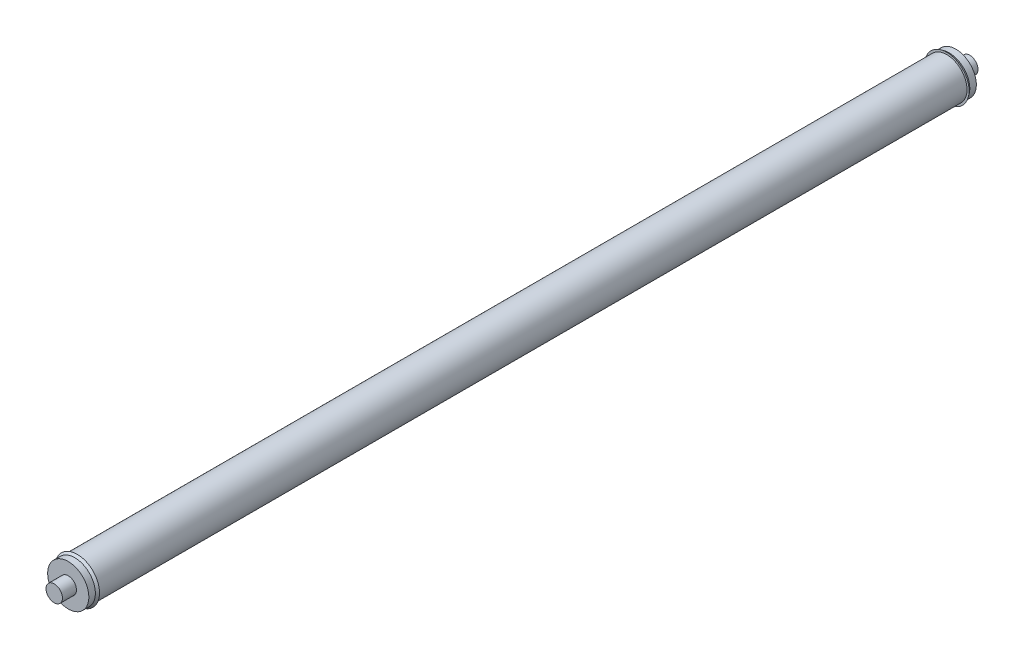
ISO-10303-21;
HEADER;
FILE_DESCRIPTION(('STEP AP214'),'2;1');
FILE_NAME('part.step','',(''),(''),'','','');
FILE_SCHEMA(('AUTOMOTIVE_DESIGN { 1 0 10303 214 1 1 1 1 }'));
ENDSEC;
DATA;
#1=APPLICATION_CONTEXT('core data for automotive mechanical design processes');
#2=APPLICATION_PROTOCOL_DEFINITION('international standard','automotive_design',2000,#1);
#3=PRODUCT_CONTEXT('',#1,'mechanical');
#4=PRODUCT('Part','Part','',(#3));
#5=PRODUCT_RELATED_PRODUCT_CATEGORY('part','',(#4));
#6=PRODUCT_DEFINITION_FORMATION('','',#4);
#7=PRODUCT_DEFINITION_CONTEXT('part definition',#1,'design');
#8=PRODUCT_DEFINITION('design','',#6,#7);
#9=PRODUCT_DEFINITION_SHAPE('','',#8);
#10=(LENGTH_UNIT() NAMED_UNIT(*) SI_UNIT(.MILLI.,.METRE.));
#11=(NAMED_UNIT(*) PLANE_ANGLE_UNIT() SI_UNIT($,.RADIAN.));
#12=(NAMED_UNIT(*) SI_UNIT($,.STERADIAN.) SOLID_ANGLE_UNIT());
#13=UNCERTAINTY_MEASURE_WITH_UNIT(LENGTH_MEASURE(1.E-05),#10,'distance_accuracy_value','');
#14=(GEOMETRIC_REPRESENTATION_CONTEXT(3) GLOBAL_UNCERTAINTY_ASSIGNED_CONTEXT((#13)) GLOBAL_UNIT_ASSIGNED_CONTEXT((#10,
#11,#12)) REPRESENTATION_CONTEXT('',''));
#15=CARTESIAN_POINT('',(0.,0.,0.));
#16=DIRECTION('',(0.,0.,1.));
#17=DIRECTION('',(1.,0.,0.));
#18=AXIS2_PLACEMENT_3D('',#15,#16,#17);
#19=CARTESIAN_POINT('',(1.01500000000002,0.,56.5));
#20=DIRECTION('',(0.,0.,-1.));
#21=DIRECTION('',(-1.,0.,0.));
#22=AXIS2_PLACEMENT_3D('',#19,#20,#21);
#23=PLANE('',#22);
#24=CARTESIAN_POINT('',(0.,0.,56.5));
#25=DIRECTION('',(0.,0.,-1.));
#26=DIRECTION('',(-1.,0.,0.));
#27=AXIS2_PLACEMENT_3D('',#24,#25,#26);
#28=CIRCLE('',#27,1.01500000000002);
#29=CARTESIAN_POINT('',(-1.01500000000002,0.,56.5));
#30=VERTEX_POINT('',#29);
#31=EDGE_CURVE('E71',#30,#30,#28,.T.);
#32=ORIENTED_EDGE('',*,*,#31,.F.);
#33=EDGE_LOOP('',(#32));
#34=FACE_BOUND('',#33,.T.);
#35=ADVANCED_FACE('F31',(#34),#23,.F.);
#36=CARTESIAN_POINT('',(1.01500000000002,0.,-56.5));
#37=DIRECTION('',(0.,0.,1.));
#38=DIRECTION('',(1.,0.,0.));
#39=AXIS2_PLACEMENT_3D('',#36,#37,#38);
#40=PLANE('',#39);
#41=CARTESIAN_POINT('',(0.,0.,-56.5));
#42=DIRECTION('',(0.,0.,-1.));
#43=DIRECTION('',(-1.,0.,0.));
#44=AXIS2_PLACEMENT_3D('',#41,#42,#43);
#45=CIRCLE('',#44,1.01500000000002);
#46=CARTESIAN_POINT('',(-1.01500000000002,0.,-56.5));
#47=VERTEX_POINT('',#46);
#48=EDGE_CURVE('E10',#47,#47,#45,.T.);
#49=ORIENTED_EDGE('',*,*,#48,.T.);
#50=EDGE_LOOP('',(#49));
#51=FACE_BOUND('',#50,.T.);
#52=ADVANCED_FACE('F78',(#51),#40,.F.);
#53=CARTESIAN_POINT('',(0.,0.,-71.4139111653637));
#54=DIRECTION('',(0.,0.,-1.));
#55=DIRECTION('',(-1.,0.,0.));
#56=AXIS2_PLACEMENT_3D('',#53,#54,#55);
#57=CYLINDRICAL_SURFACE('',#56,1.01500000000002);
#58=ORIENTED_EDGE('',*,*,#48,.F.);
#59=EDGE_LOOP('',(#58));
#60=FACE_BOUND('',#59,.T.);
#61=CARTESIAN_POINT('',(0.,0.,-54.77));
#62=DIRECTION('',(0.,0.,-1.));
#63=DIRECTION('',(-1.,0.,0.));
#64=AXIS2_PLACEMENT_3D('',#61,#62,#63);
#65=CIRCLE('',#64,1.01500000000002);
#66=CARTESIAN_POINT('',(-1.01500000000002,0.,-54.77));
#67=VERTEX_POINT('',#66);
#68=EDGE_CURVE('E37',#67,#67,#65,.T.);
#69=ORIENTED_EDGE('',*,*,#68,.T.);
#70=EDGE_LOOP('',(#69));
#71=FACE_BOUND('',#70,.T.);
#72=ADVANCED_FACE('F82',(#60,#71),#57,.T.);
#73=CARTESIAN_POINT('',(2.54000000000002,0.,-54.77));
#74=DIRECTION('',(0.,0.,1.));
#75=DIRECTION('',(1.,0.,0.));
#76=AXIS2_PLACEMENT_3D('',#73,#74,#75);
#77=PLANE('',#76);
#78=ORIENTED_EDGE('',*,*,#68,.F.);
#79=EDGE_LOOP('',(#78));
#80=FACE_BOUND('',#79,.T.);
#81=CARTESIAN_POINT('',(0.,0.,-54.77));
#82=DIRECTION('',(0.,0.,-1.));
#83=DIRECTION('',(-1.,0.,0.));
#84=AXIS2_PLACEMENT_3D('',#81,#82,#83);
#85=CIRCLE('',#84,2.54000000000002);
#86=CARTESIAN_POINT('',(-2.54000000000002,0.,-54.77));
#87=VERTEX_POINT('',#86);
#88=EDGE_CURVE('E41',#87,#87,#85,.T.);
#89=ORIENTED_EDGE('',*,*,#88,.T.);
#90=EDGE_LOOP('',(#89));
#91=FACE_BOUND('',#90,.T.);
#92=ADVANCED_FACE('F86',(#80,#91),#77,.F.);
#93=CARTESIAN_POINT('',(0.,0.,-71.4139111653637));
#94=DIRECTION('',(0.,0.,-1.));
#95=DIRECTION('',(-1.,0.,0.));
#96=AXIS2_PLACEMENT_3D('',#93,#94,#95);
#97=CYLINDRICAL_SURFACE('',#96,2.54000000000002);
#98=ORIENTED_EDGE('',*,*,#88,.F.);
#99=EDGE_LOOP('',(#98));
#100=FACE_BOUND('',#99,.T.);
#101=CARTESIAN_POINT('',(0.,0.,-53.96));
#102=DIRECTION('',(0.,0.,-1.));
#103=DIRECTION('',(-1.,0.,0.));
#104=AXIS2_PLACEMENT_3D('',#101,#102,#103);
#105=CIRCLE('',#104,2.54000000000002);
#106=CARTESIAN_POINT('',(-2.54000000000002,0.,-53.96));
#107=VERTEX_POINT('',#106);
#108=EDGE_CURVE('E45',#107,#107,#105,.T.);
#109=ORIENTED_EDGE('',*,*,#108,.T.);
#110=EDGE_LOOP('',(#109));
#111=FACE_BOUND('',#110,.T.);
#112=ADVANCED_FACE('F92',(#100,#111),#97,.T.);
#113=CARTESIAN_POINT('',(0.,0.,-53.66));
#114=DIRECTION('',(0.,0.,1.));
#115=DIRECTION('',(1.,0.,0.));
#116=AXIS2_PLACEMENT_3D('',#113,#114,#115);
#117=CONICAL_SURFACE('',#116,2.75000000000002,0.610725964389226);
#118=ORIENTED_EDGE('',*,*,#108,.F.);
#119=EDGE_LOOP('',(#118));
#120=FACE_BOUND('',#119,.T.);
#121=CARTESIAN_POINT('',(0.,0.,-53.66));
#122=DIRECTION('',(0.,0.,-1.));
#123=DIRECTION('',(-1.,0.,0.));
#124=AXIS2_PLACEMENT_3D('',#121,#122,#123);
#125=CIRCLE('',#124,2.75000000000002);
#126=CARTESIAN_POINT('',(-2.75000000000002,0.,-53.66));
#127=VERTEX_POINT('',#126);
#128=EDGE_CURVE('E50',#127,#127,#125,.T.);
#129=ORIENTED_EDGE('',*,*,#128,.T.);
#130=EDGE_LOOP('',(#129));
#131=FACE_BOUND('',#130,.T.);
#132=ADVANCED_FACE('F96',(#120,#131),#117,.T.);
#133=CARTESIAN_POINT('',(2.50000000000002,0.,-53.66));
#134=DIRECTION('',(0.,0.,-1.));
#135=DIRECTION('',(-1.,0.,0.));
#136=AXIS2_PLACEMENT_3D('',#133,#134,#135);
#137=PLANE('',#136);
#138=ORIENTED_EDGE('',*,*,#128,.F.);
#139=EDGE_LOOP('',(#138));
#140=FACE_BOUND('',#139,.T.);
#141=CARTESIAN_POINT('',(0.,0.,-53.66));
#142=DIRECTION('',(0.,0.,-1.));
#143=DIRECTION('',(-1.,0.,0.));
#144=AXIS2_PLACEMENT_3D('',#141,#142,#143);
#145=CIRCLE('',#144,2.50000000000002);
#146=CARTESIAN_POINT('',(-2.50000000000002,0.,-53.66));
#147=VERTEX_POINT('',#146);
#148=EDGE_CURVE('E53',#147,#147,#145,.T.);
#149=ORIENTED_EDGE('',*,*,#148,.T.);
#150=EDGE_LOOP('',(#149));
#151=FACE_BOUND('',#150,.T.);
#152=ADVANCED_FACE('F100',(#140,#151),#137,.F.);
#153=CARTESIAN_POINT('',(0.,0.,-71.4139111653637));
#154=DIRECTION('',(0.,0.,-1.));
#155=DIRECTION('',(-1.,0.,0.));
#156=AXIS2_PLACEMENT_3D('',#153,#154,#155);
#157=CYLINDRICAL_SURFACE('',#156,2.50000000000002);
#158=ORIENTED_EDGE('',*,*,#148,.F.);
#159=EDGE_LOOP('',(#158));
#160=FACE_BOUND('',#159,.T.);
#161=CARTESIAN_POINT('',(0.,0.,53.66));
#162=DIRECTION('',(0.,0.,-1.));
#163=DIRECTION('',(-1.,0.,0.));
#164=AXIS2_PLACEMENT_3D('',#161,#162,#163);
#165=CIRCLE('',#164,2.50000000000002);
#166=CARTESIAN_POINT('',(-2.50000000000002,0.,53.66));
#167=VERTEX_POINT('',#166);
#168=EDGE_CURVE('E56',#167,#167,#165,.T.);
#169=ORIENTED_EDGE('',*,*,#168,.T.);
#170=EDGE_LOOP('',(#169));
#171=FACE_BOUND('',#170,.T.);
#172=ADVANCED_FACE('F104',(#160,#171),#157,.T.);
#173=CARTESIAN_POINT('',(2.50000000000002,0.,53.66));
#174=DIRECTION('',(0.,0.,1.));
#175=DIRECTION('',(1.,0.,0.));
#176=AXIS2_PLACEMENT_3D('',#173,#174,#175);
#177=PLANE('',#176);
#178=ORIENTED_EDGE('',*,*,#168,.F.);
#179=EDGE_LOOP('',(#178));
#180=FACE_BOUND('',#179,.T.);
#181=CARTESIAN_POINT('',(0.,0.,53.66));
#182=DIRECTION('',(0.,0.,-1.));
#183=DIRECTION('',(-1.,0.,0.));
#184=AXIS2_PLACEMENT_3D('',#181,#182,#183);
#185=CIRCLE('',#184,2.75000000000002);
#186=CARTESIAN_POINT('',(-2.75000000000002,0.,53.66));
#187=VERTEX_POINT('',#186);
#188=EDGE_CURVE('E59',#187,#187,#185,.T.);
#189=ORIENTED_EDGE('',*,*,#188,.T.);
#190=EDGE_LOOP('',(#189));
#191=FACE_BOUND('',#190,.T.);
#192=ADVANCED_FACE('F108',(#180,#191),#177,.F.);
#193=CARTESIAN_POINT('',(0.,0.,53.96));
#194=DIRECTION('',(0.,0.,-1.));
#195=DIRECTION('',(-1.,0.,0.));
#196=AXIS2_PLACEMENT_3D('',#193,#194,#195);
#197=CONICAL_SURFACE('',#196,2.54000000000002,0.610725964389215);
#198=ORIENTED_EDGE('',*,*,#188,.F.);
#199=EDGE_LOOP('',(#198));
#200=FACE_BOUND('',#199,.T.);
#201=CARTESIAN_POINT('',(0.,0.,53.96));
#202=DIRECTION('',(0.,0.,-1.));
#203=DIRECTION('',(-1.,0.,0.));
#204=AXIS2_PLACEMENT_3D('',#201,#202,#203);
#205=CIRCLE('',#204,2.54000000000002);
#206=CARTESIAN_POINT('',(-2.54000000000002,0.,53.96));
#207=VERTEX_POINT('',#206);
#208=EDGE_CURVE('E62',#207,#207,#205,.T.);
#209=ORIENTED_EDGE('',*,*,#208,.T.);
#210=EDGE_LOOP('',(#209));
#211=FACE_BOUND('',#210,.T.);
#212=ADVANCED_FACE('F112',(#200,#211),#197,.T.);
#213=CARTESIAN_POINT('',(0.,0.,-71.4139111653637));
#214=DIRECTION('',(0.,0.,-1.));
#215=DIRECTION('',(-1.,0.,0.));
#216=AXIS2_PLACEMENT_3D('',#213,#214,#215);
#217=CYLINDRICAL_SURFACE('',#216,2.54000000000002);
#218=ORIENTED_EDGE('',*,*,#208,.F.);
#219=EDGE_LOOP('',(#218));
#220=FACE_BOUND('',#219,.T.);
#221=CARTESIAN_POINT('',(0.,0.,54.77));
#222=DIRECTION('',(0.,0.,-1.));
#223=DIRECTION('',(-1.,0.,0.));
#224=AXIS2_PLACEMENT_3D('',#221,#222,#223);
#225=CIRCLE('',#224,2.54000000000002);
#226=CARTESIAN_POINT('',(-2.54000000000002,0.,54.77));
#227=VERTEX_POINT('',#226);
#228=EDGE_CURVE('E65',#227,#227,#225,.T.);
#229=ORIENTED_EDGE('',*,*,#228,.T.);
#230=EDGE_LOOP('',(#229));
#231=FACE_BOUND('',#230,.T.);
#232=ADVANCED_FACE('F116',(#220,#231),#217,.T.);
#233=CARTESIAN_POINT('',(2.54000000000002,0.,54.77));
#234=DIRECTION('',(0.,0.,-1.));
#235=DIRECTION('',(-1.,0.,0.));
#236=AXIS2_PLACEMENT_3D('',#233,#234,#235);
#237=PLANE('',#236);
#238=ORIENTED_EDGE('',*,*,#228,.F.);
#239=EDGE_LOOP('',(#238));
#240=FACE_BOUND('',#239,.T.);
#241=CARTESIAN_POINT('',(0.,0.,54.77));
#242=DIRECTION('',(0.,0.,-1.));
#243=DIRECTION('',(-1.,0.,0.));
#244=AXIS2_PLACEMENT_3D('',#241,#242,#243);
#245=CIRCLE('',#244,1.01500000000002);
#246=CARTESIAN_POINT('',(-1.01500000000002,0.,54.77));
#247=VERTEX_POINT('',#246);
#248=EDGE_CURVE('E68',#247,#247,#245,.T.);
#249=ORIENTED_EDGE('',*,*,#248,.T.);
#250=EDGE_LOOP('',(#249));
#251=FACE_BOUND('',#250,.T.);
#252=ADVANCED_FACE('F120',(#240,#251),#237,.F.);
#253=CARTESIAN_POINT('',(0.,0.,-71.4139111653637));
#254=DIRECTION('',(0.,0.,-1.));
#255=DIRECTION('',(-1.,0.,0.));
#256=AXIS2_PLACEMENT_3D('',#253,#254,#255);
#257=CYLINDRICAL_SURFACE('',#256,1.01500000000002);
#258=ORIENTED_EDGE('',*,*,#248,.F.);
#259=EDGE_LOOP('',(#258));
#260=FACE_BOUND('',#259,.T.);
#261=ORIENTED_EDGE('',*,*,#31,.T.);
#262=EDGE_LOOP('',(#261));
#263=FACE_BOUND('',#262,.T.);
#264=ADVANCED_FACE('F75',(#260,#263),#257,.T.);
#265=CLOSED_SHELL('',(#35,#52,#72,#92,#112,#132,#152,#172,#192,#212,#232,#252,#264));
#266=MANIFOLD_SOLID_BREP('B2',#265);
#267=ADVANCED_BREP_SHAPE_REPRESENTATION('',(#18,#266),#14);
#268=SHAPE_DEFINITION_REPRESENTATION(#9,#267);
ENDSEC;
END-ISO-10303-21;
